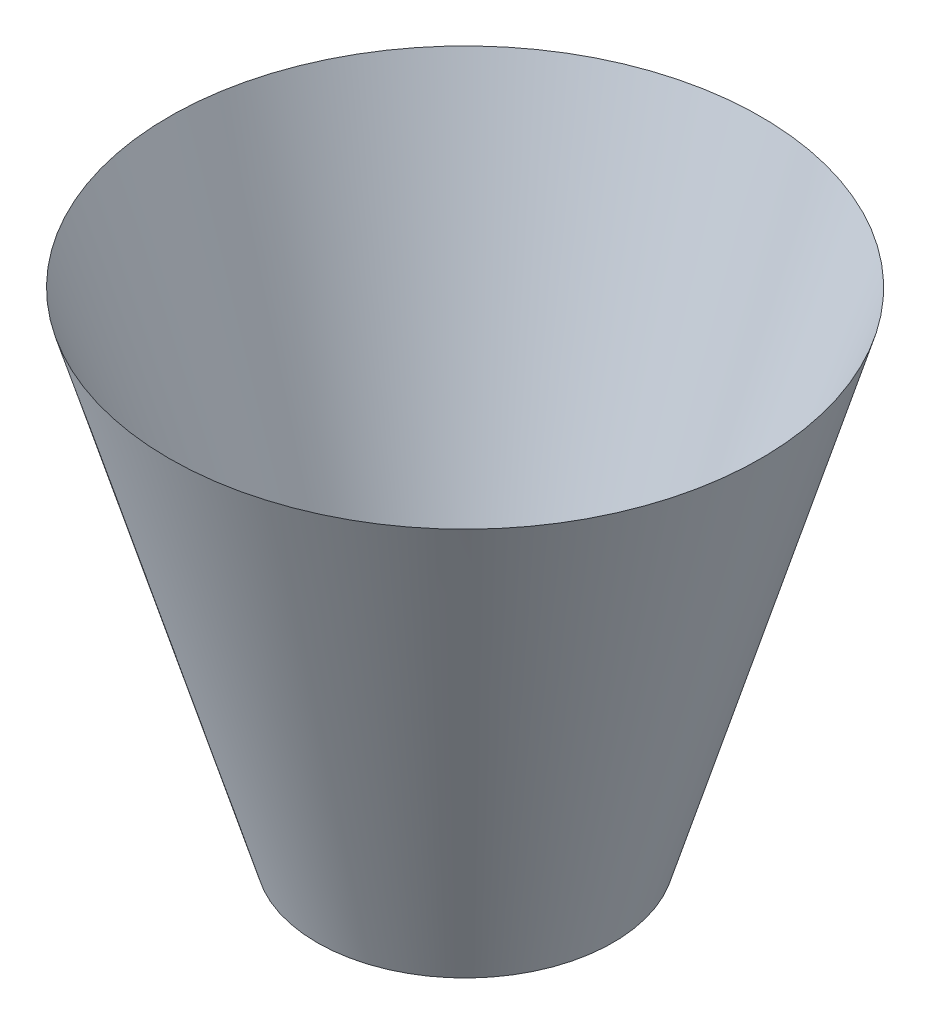
ISO-10303-21;
HEADER;
FILE_DESCRIPTION(('STEP AP214'),'2;1');
FILE_NAME('part.step','',(''),(''),'','','');
FILE_SCHEMA(('AUTOMOTIVE_DESIGN { 1 0 10303 214 1 1 1 1 }'));
ENDSEC;
DATA;
#1=APPLICATION_CONTEXT('core data for automotive mechanical design processes');
#2=APPLICATION_PROTOCOL_DEFINITION('international standard','automotive_design',2000,#1);
#3=PRODUCT_CONTEXT('',#1,'mechanical');
#4=PRODUCT('Part','Part','',(#3));
#5=PRODUCT_RELATED_PRODUCT_CATEGORY('part','',(#4));
#6=PRODUCT_DEFINITION_FORMATION('','',#4);
#7=PRODUCT_DEFINITION_CONTEXT('part definition',#1,'design');
#8=PRODUCT_DEFINITION('design','',#6,#7);
#9=PRODUCT_DEFINITION_SHAPE('','',#8);
#10=(LENGTH_UNIT() NAMED_UNIT(*) SI_UNIT(.MILLI.,.METRE.));
#11=(NAMED_UNIT(*) PLANE_ANGLE_UNIT() SI_UNIT($,.RADIAN.));
#12=(NAMED_UNIT(*) SI_UNIT($,.STERADIAN.) SOLID_ANGLE_UNIT());
#13=UNCERTAINTY_MEASURE_WITH_UNIT(LENGTH_MEASURE(1.E-05),#10,'distance_accuracy_value','');
#14=(GEOMETRIC_REPRESENTATION_CONTEXT(3) GLOBAL_UNCERTAINTY_ASSIGNED_CONTEXT((#13)) GLOBAL_UNIT_ASSIGNED_CONTEXT((#10,
#11,#12)) REPRESENTATION_CONTEXT('',''));
#15=CARTESIAN_POINT('',(0.,0.,0.));
#16=DIRECTION('',(0.,0.,1.));
#17=DIRECTION('',(1.,0.,0.));
#18=AXIS2_PLACEMENT_3D('',#15,#16,#17);
#19=CARTESIAN_POINT('',(0.,0.,0.));
#20=DIRECTION('',(0.,1.,0.));
#21=DIRECTION('',(0.,0.,1.));
#22=AXIS2_PLACEMENT_3D('',#19,#20,#21);
#23=PLANE('',#22);
#24=CARTESIAN_POINT('',(0.,0.,0.));
#25=DIRECTION('',(0.,1.,0.));
#26=DIRECTION('',(0.,0.,1.));
#27=AXIS2_PLACEMENT_3D('',#24,#25,#26);
#28=CIRCLE('',#27,250.);
#29=CARTESIAN_POINT('',(0.,0.,250.));
#30=VERTEX_POINT('',#29);
#31=EDGE_CURVE('E51',#30,#30,#28,.T.);
#32=ORIENTED_EDGE('',*,*,#31,.T.);
#33=EDGE_LOOP('',(#32));
#34=FACE_BOUND('',#33,.T.);
#35=CARTESIAN_POINT('',(0.,0.,0.));
#36=DIRECTION('',(0.,1.,0.));
#37=DIRECTION('',(0.,0.,1.));
#38=AXIS2_PLACEMENT_3D('',#35,#36,#37);
#39=CIRCLE('',#38,300.);
#40=CARTESIAN_POINT('',(0.,0.,300.));
#41=VERTEX_POINT('',#40);
#42=EDGE_CURVE('E11',#41,#41,#39,.T.);
#43=ORIENTED_EDGE('',*,*,#42,.F.);
#44=EDGE_LOOP('',(#43));
#45=FACE_BOUND('',#44,.T.);
#46=ADVANCED_FACE('F37',(#34,#45),#23,.F.);
#47=CARTESIAN_POINT('',(0.,0.,0.));
#48=DIRECTION('',(0.,1.,0.));
#49=DIRECTION('',(0.,0.,1.));
#50=AXIS2_PLACEMENT_3D('',#47,#48,#49);
#51=CONICAL_SURFACE('',#50,300.,0.291456794477867);
#52=ORIENTED_EDGE('',*,*,#42,.T.);
#53=EDGE_LOOP('',(#52));
#54=FACE_BOUND('',#53,.T.);
#55=CARTESIAN_POINT('',(0.,1000.,0.));
#56=DIRECTION('',(0.,1.,0.));
#57=DIRECTION('',(0.,0.,1.));
#58=AXIS2_PLACEMENT_3D('',#55,#56,#57);
#59=CIRCLE('',#58,600.);
#60=CARTESIAN_POINT('',(0.,1000.,600.));
#61=VERTEX_POINT('',#60);
#62=EDGE_CURVE('E46',#61,#61,#59,.T.);
#63=ORIENTED_EDGE('',*,*,#62,.F.);
#64=EDGE_LOOP('',(#63));
#65=FACE_BOUND('',#64,.T.);
#66=ADVANCED_FACE('F39',(#54,#65),#51,.T.);
#67=CARTESIAN_POINT('',(0.,0.,0.));
#68=DIRECTION('',(0.,1.,0.));
#69=DIRECTION('',(0.,0.,1.));
#70=AXIS2_PLACEMENT_3D('',#67,#68,#69);
#71=CONICAL_SURFACE('',#70,250.,0.336674819386727);
#72=ORIENTED_EDGE('',*,*,#31,.F.);
#73=EDGE_LOOP('',(#72));
#74=FACE_BOUND('',#73,.T.);
#75=ORIENTED_EDGE('',*,*,#62,.T.);
#76=EDGE_LOOP('',(#75));
#77=FACE_BOUND('',#76,.T.);
#78=ADVANCED_FACE('F67',(#74,#77),#71,.F.);
#79=CLOSED_SHELL('',(#46,#66,#78));
#80=MANIFOLD_SOLID_BREP('B2',#79);
#81=ADVANCED_BREP_SHAPE_REPRESENTATION('',(#18,#80),#14);
#82=SHAPE_DEFINITION_REPRESENTATION(#9,#81);
ENDSEC;
END-ISO-10303-21;
